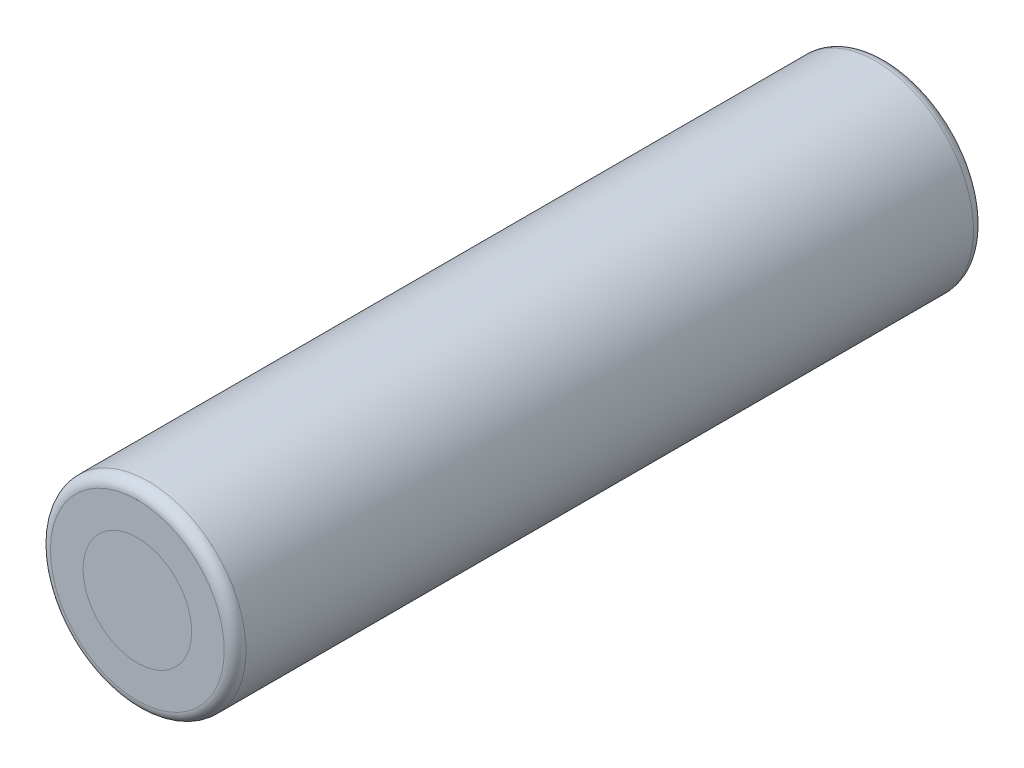
ISO-10303-21;
HEADER;
FILE_DESCRIPTION(('STEP AP214'),'2;1');
FILE_NAME('part.step','',(''),(''),'','','');
FILE_SCHEMA(('AUTOMOTIVE_DESIGN { 1 0 10303 214 1 1 1 1 }'));
ENDSEC;
DATA;
#1=APPLICATION_CONTEXT('core data for automotive mechanical design processes');
#2=APPLICATION_PROTOCOL_DEFINITION('international standard','automotive_design',2000,#1);
#3=PRODUCT_CONTEXT('',#1,'mechanical');
#4=PRODUCT('Part','Part','',(#3));
#5=PRODUCT_RELATED_PRODUCT_CATEGORY('part','',(#4));
#6=PRODUCT_DEFINITION_FORMATION('','',#4);
#7=PRODUCT_DEFINITION_CONTEXT('part definition',#1,'design');
#8=PRODUCT_DEFINITION('design','',#6,#7);
#9=PRODUCT_DEFINITION_SHAPE('','',#8);
#10=(LENGTH_UNIT() NAMED_UNIT(*) SI_UNIT(.MILLI.,.METRE.));
#11=(NAMED_UNIT(*) PLANE_ANGLE_UNIT() SI_UNIT($,.RADIAN.));
#12=(NAMED_UNIT(*) SI_UNIT($,.STERADIAN.) SOLID_ANGLE_UNIT());
#13=UNCERTAINTY_MEASURE_WITH_UNIT(LENGTH_MEASURE(1.E-05),#10,'distance_accuracy_value','');
#14=(GEOMETRIC_REPRESENTATION_CONTEXT(3) GLOBAL_UNCERTAINTY_ASSIGNED_CONTEXT((#13)) GLOBAL_UNIT_ASSIGNED_CONTEXT((#10,
#11,#12)) REPRESENTATION_CONTEXT('',''));
#15=CARTESIAN_POINT('',(0.,0.,0.));
#16=DIRECTION('',(0.,0.,1.));
#17=DIRECTION('',(1.,0.,0.));
#18=AXIS2_PLACEMENT_3D('',#15,#16,#17);
#19=CARTESIAN_POINT('',(0.,0.,69.));
#20=DIRECTION('',(0.,0.,1.));
#21=DIRECTION('',(1.,0.,0.));
#22=AXIS2_PLACEMENT_3D('',#19,#20,#21);
#23=PLANE('',#22);
#24=CARTESIAN_POINT('',(0.,0.,69.));
#25=DIRECTION('',(0.,0.,-1.));
#26=DIRECTION('',(1.,0.,0.));
#27=AXIS2_PLACEMENT_3D('',#24,#25,#26);
#28=CIRCLE('',#27,5.00000007450581);
#29=CARTESIAN_POINT('',(-5.00000007450581,0.,69.));
#30=VERTEX_POINT('',#29);
#31=EDGE_CURVE('P0_E20',#30,#30,#28,.T.);
#32=ORIENTED_EDGE('',*,*,#31,.T.);
#33=EDGE_LOOP('',(#32));
#34=FACE_BOUND('',#33,.T.);
#35=CARTESIAN_POINT('',(0.,0.,69.));
#36=DIRECTION('',(0.,0.,-1.));
#37=DIRECTION('',(1.,0.,0.));
#38=AXIS2_PLACEMENT_3D('',#35,#36,#37);
#39=CIRCLE('',#38,8.);
#40=CARTESIAN_POINT('',(-8.,0.,69.));
#41=VERTEX_POINT('',#40);
#42=EDGE_CURVE('P0_E27',#41,#41,#39,.T.);
#43=ORIENTED_EDGE('',*,*,#42,.F.);
#44=EDGE_LOOP('',(#43));
#45=FACE_BOUND('',#44,.T.);
#46=ADVANCED_FACE('P0_F16',(#34,#45),#23,.T.);
#47=CARTESIAN_POINT('',(0.,0.,68.));
#48=DIRECTION('',(0.,0.,1.));
#49=DIRECTION('',(1.,0.,0.));
#50=AXIS2_PLACEMENT_3D('',#47,#48,#49);
#51=TOROIDAL_SURFACE('',#50,8.,1.);
#52=ORIENTED_EDGE('',*,*,#42,.T.);
#53=CARTESIAN_POINT('',(-8.,0.,68.));
#54=DIRECTION('',(0.,-1.,0.));
#55=DIRECTION('',(-1.,0.,0.));
#56=AXIS2_PLACEMENT_3D('',#53,#54,#55);
#57=CIRCLE('',#56,1.);
#58=CARTESIAN_POINT('',(-9.,0.,68.));
#59=VERTEX_POINT('',#58);
#60=EDGE_CURVE('P0_E11',#41,#59,#57,.T.);
#61=ORIENTED_EDGE('',*,*,#60,.T.);
#62=CARTESIAN_POINT('',(0.,0.,68.));
#63=DIRECTION('',(0.,0.,1.));
#64=DIRECTION('',(1.,0.,0.));
#65=AXIS2_PLACEMENT_3D('',#62,#63,#64);
#66=CIRCLE('',#65,9.);
#67=EDGE_CURVE('P0_E60',#59,#59,#66,.T.);
#68=ORIENTED_EDGE('',*,*,#67,.T.);
#69=ORIENTED_EDGE('',*,*,#60,.F.);
#70=EDGE_LOOP('',(#52,#61,#68,#69));
#71=FACE_BOUND('',#70,.T.);
#72=ADVANCED_FACE('P0_F18',(#71),#51,.T.);
#73=CARTESIAN_POINT('',(0.,0.,0.));
#74=DIRECTION('',(0.,0.,1.));
#75=DIRECTION('',(1.,0.,0.));
#76=AXIS2_PLACEMENT_3D('',#73,#74,#75);
#77=PLANE('',#76);
#78=CARTESIAN_POINT('',(0.,0.,0.));
#79=DIRECTION('',(0.,0.,1.));
#80=DIRECTION('',(1.,0.,0.));
#81=AXIS2_PLACEMENT_3D('',#78,#79,#80);
#82=CIRCLE('',#81,5.00000007450581);
#83=CARTESIAN_POINT('',(-5.00000007450581,0.,0.));
#84=VERTEX_POINT('',#83);
#85=EDGE_CURVE('P0_E74',#84,#84,#82,.T.);
#86=ORIENTED_EDGE('',*,*,#85,.T.);
#87=EDGE_LOOP('',(#86));
#88=FACE_BOUND('',#87,.T.);
#89=CARTESIAN_POINT('',(0.,0.,0.));
#90=DIRECTION('',(0.,0.,1.));
#91=DIRECTION('',(1.,0.,0.));
#92=AXIS2_PLACEMENT_3D('',#89,#90,#91);
#93=CIRCLE('',#92,8.);
#94=CARTESIAN_POINT('',(-8.,0.,0.));
#95=VERTEX_POINT('',#94);
#96=EDGE_CURVE('P0_E54',#95,#95,#93,.T.);
#97=ORIENTED_EDGE('',*,*,#96,.F.);
#98=EDGE_LOOP('',(#97));
#99=FACE_BOUND('',#98,.T.);
#100=ADVANCED_FACE('P0_F113',(#88,#99),#77,.F.);
#101=CARTESIAN_POINT('',(0.,0.,0.));
#102=DIRECTION('',(0.,0.,1.));
#103=DIRECTION('',(1.,0.,0.));
#104=AXIS2_PLACEMENT_3D('',#101,#102,#103);
#105=CYLINDRICAL_SURFACE('',#104,9.);
#106=ORIENTED_EDGE('',*,*,#67,.F.);
#107=DIRECTION('',(0.,0.,-1.));
#108=VECTOR('',#107,1.);
#109=CARTESIAN_POINT('',(-9.,0.,0.));
#110=LINE('',#109,#108);
#111=CARTESIAN_POINT('',(-9.,0.,1.));
#112=VERTEX_POINT('',#111);
#113=EDGE_CURVE('P0_E67',#59,#112,#110,.T.);
#114=ORIENTED_EDGE('',*,*,#113,.T.);
#115=CARTESIAN_POINT('',(0.,0.,1.));
#116=DIRECTION('',(0.,0.,-1.));
#117=DIRECTION('',(1.,0.,0.));
#118=AXIS2_PLACEMENT_3D('',#115,#116,#117);
#119=CIRCLE('',#118,9.);
#120=EDGE_CURVE('P0_E68',#112,#112,#119,.T.);
#121=ORIENTED_EDGE('',*,*,#120,.F.);
#122=ORIENTED_EDGE('',*,*,#113,.F.);
#123=EDGE_LOOP('',(#106,#114,#121,#122));
#124=FACE_BOUND('',#123,.T.);
#125=ADVANCED_FACE('P0_F120',(#124),#105,.T.);
#126=CARTESIAN_POINT('',(0.,0.,1.));
#127=DIRECTION('',(0.,0.,1.));
#128=DIRECTION('',(1.,0.,0.));
#129=AXIS2_PLACEMENT_3D('',#126,#127,#128);
#130=TOROIDAL_SURFACE('',#129,8.,1.);
#131=ORIENTED_EDGE('',*,*,#120,.T.);
#132=CARTESIAN_POINT('',(-8.,0.,1.));
#133=DIRECTION('',(0.,-1.,0.));
#134=DIRECTION('',(-1.,0.,0.));
#135=AXIS2_PLACEMENT_3D('',#132,#133,#134);
#136=CIRCLE('',#135,1.);
#137=EDGE_CURVE('P0_E57',#112,#95,#136,.T.);
#138=ORIENTED_EDGE('',*,*,#137,.T.);
#139=ORIENTED_EDGE('',*,*,#96,.T.);
#140=ORIENTED_EDGE('',*,*,#137,.F.);
#141=EDGE_LOOP('',(#131,#138,#139,#140));
#142=FACE_BOUND('',#141,.T.);
#143=ADVANCED_FACE('P0_F56',(#142),#130,.T.);
#144=CARTESIAN_POINT('',(0.,0.,0.));
#145=DIRECTION('',(0.,0.,1.));
#146=DIRECTION('',(1.,0.,0.));
#147=AXIS2_PLACEMENT_3D('',#144,#145,#146);
#148=CYLINDRICAL_SURFACE('',#147,5.00000007450581);
#149=ORIENTED_EDGE('',*,*,#85,.F.);
#150=DIRECTION('',(0.,0.,1.));
#151=VECTOR('',#150,1.);
#152=CARTESIAN_POINT('',(-5.00000007450581,0.,0.));
#153=LINE('',#152,#151);
#154=EDGE_CURVE('P0_E77',#84,#30,#153,.T.);
#155=ORIENTED_EDGE('',*,*,#154,.T.);
#156=ORIENTED_EDGE('',*,*,#31,.F.);
#157=ORIENTED_EDGE('',*,*,#154,.F.);
#158=EDGE_LOOP('',(#149,#155,#156,#157));
#159=FACE_BOUND('',#158,.T.);
#160=ADVANCED_FACE('P0_F115',(#159),#148,.F.);
#161=CLOSED_SHELL('',(#46,#72,#100,#125,#143,#160));
#162=MANIFOLD_SOLID_BREP('P0_B1',#161);
#163=CARTESIAN_POINT('',(0.,0.,69.));
#164=DIRECTION('',(0.,0.,1.));
#165=DIRECTION('',(1.,0.,0.));
#166=AXIS2_PLACEMENT_3D('',#163,#164,#165);
#167=PLANE('',#166);
#168=CARTESIAN_POINT('',(0.,0.,69.));
#169=DIRECTION('',(0.,0.,-1.));
#170=DIRECTION('',(1.,0.,0.));
#171=AXIS2_PLACEMENT_3D('',#168,#169,#170);
#172=CIRCLE('',#171,5.00000007450581);
#173=CARTESIAN_POINT('',(-5.00000007450581,0.,69.));
#174=VERTEX_POINT('',#173);
#175=EDGE_CURVE('P1_E39',#174,#174,#172,.T.);
#176=ORIENTED_EDGE('',*,*,#175,.F.);
#177=EDGE_LOOP('',(#176));
#178=FACE_BOUND('',#177,.T.);
#179=ADVANCED_FACE('P1_F15',(#178),#167,.T.);
#180=CARTESIAN_POINT('',(0.,0.,0.));
#181=DIRECTION('',(0.,0.,1.));
#182=DIRECTION('',(1.,0.,0.));
#183=AXIS2_PLACEMENT_3D('',#180,#181,#182);
#184=PLANE('',#183);
#185=CARTESIAN_POINT('',(0.,0.,0.));
#186=DIRECTION('',(0.,0.,1.));
#187=DIRECTION('',(1.,0.,0.));
#188=AXIS2_PLACEMENT_3D('',#185,#186,#187);
#189=CIRCLE('',#188,5.00000007450581);
#190=CARTESIAN_POINT('',(-5.00000007450581,0.,0.));
#191=VERTEX_POINT('',#190);
#192=EDGE_CURVE('P1_E10',#191,#191,#189,.T.);
#193=ORIENTED_EDGE('',*,*,#192,.F.);
#194=EDGE_LOOP('',(#193));
#195=FACE_BOUND('',#194,.T.);
#196=ADVANCED_FACE('P1_F63',(#195),#184,.F.);
#197=CARTESIAN_POINT('',(0.,0.,0.));
#198=DIRECTION('',(0.,0.,1.));
#199=DIRECTION('',(1.,0.,0.));
#200=AXIS2_PLACEMENT_3D('',#197,#198,#199);
#201=CYLINDRICAL_SURFACE('',#200,5.00000007450581);
#202=ORIENTED_EDGE('',*,*,#175,.T.);
#203=DIRECTION('',(0.,0.,-1.));
#204=VECTOR('',#203,1.);
#205=CARTESIAN_POINT('',(-5.00000007450581,0.,0.));
#206=LINE('',#205,#204);
#207=EDGE_CURVE('P1_E24',#174,#191,#206,.T.);
#208=ORIENTED_EDGE('',*,*,#207,.T.);
#209=ORIENTED_EDGE('',*,*,#192,.T.);
#210=ORIENTED_EDGE('',*,*,#207,.F.);
#211=EDGE_LOOP('',(#202,#208,#209,#210));
#212=FACE_BOUND('',#211,.T.);
#213=ADVANCED_FACE('P1_F37',(#212),#201,.T.);
#214=CLOSED_SHELL('',(#179,#196,#213));
#215=MANIFOLD_SOLID_BREP('P1_B1',#214);
#216=ADVANCED_BREP_SHAPE_REPRESENTATION('',(#18,#162,#215),#14);
#217=SHAPE_DEFINITION_REPRESENTATION(#9,#216);
ENDSEC;
END-ISO-10303-21;
